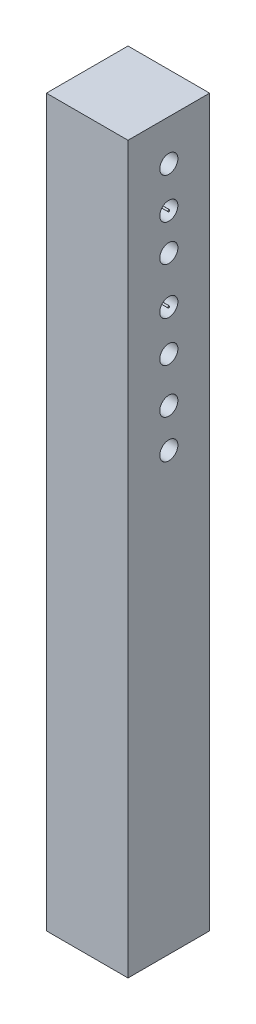
ISO-10303-21;
HEADER;
FILE_DESCRIPTION(('STEP AP214'),'2;1');
FILE_NAME('part.step','',(''),(''),'','','');
FILE_SCHEMA(('AUTOMOTIVE_DESIGN { 1 0 10303 214 1 1 1 1 }'));
ENDSEC;
DATA;
#1=APPLICATION_CONTEXT('core data for automotive mechanical design processes');
#2=APPLICATION_PROTOCOL_DEFINITION('international standard','automotive_design',2000,#1);
#3=PRODUCT_CONTEXT('',#1,'mechanical');
#4=PRODUCT('Part','Part','',(#3));
#5=PRODUCT_RELATED_PRODUCT_CATEGORY('part','',(#4));
#6=PRODUCT_DEFINITION_FORMATION('','',#4);
#7=PRODUCT_DEFINITION_CONTEXT('part definition',#1,'design');
#8=PRODUCT_DEFINITION('design','',#6,#7);
#9=PRODUCT_DEFINITION_SHAPE('','',#8);
#10=(LENGTH_UNIT() NAMED_UNIT(*) SI_UNIT(.MILLI.,.METRE.));
#11=(NAMED_UNIT(*) PLANE_ANGLE_UNIT() SI_UNIT($,.RADIAN.));
#12=(NAMED_UNIT(*) SI_UNIT($,.STERADIAN.) SOLID_ANGLE_UNIT());
#13=UNCERTAINTY_MEASURE_WITH_UNIT(LENGTH_MEASURE(1.E-05),#10,'distance_accuracy_value','');
#14=(GEOMETRIC_REPRESENTATION_CONTEXT(3) GLOBAL_UNCERTAINTY_ASSIGNED_CONTEXT((#13)) GLOBAL_UNIT_ASSIGNED_CONTEXT((#10,
#11,#12)) REPRESENTATION_CONTEXT('',''));
#15=CARTESIAN_POINT('',(0.,0.,0.));
#16=DIRECTION('',(0.,0.,1.));
#17=DIRECTION('',(1.,0.,0.));
#18=AXIS2_PLACEMENT_3D('',#15,#16,#17);
#19=CARTESIAN_POINT('',(-88.5189372888084,-800.,53.6416601542779));
#20=DIRECTION('',(-1.,0.,0.));
#21=DIRECTION('',(0.,0.,1.));
#22=AXIS2_PLACEMENT_3D('',#19,#20,#21);
#23=PLANE('',#22);
#24=CARTESIAN_POINT('',(-88.5189372888084,-44.9674941373046,8.64166015427792));
#25=DIRECTION('',(1.,0.,0.));
#26=DIRECTION('',(0.,0.,-1.));
#27=AXIS2_PLACEMENT_3D('',#24,#25,#26);
#28=CIRCLE('',#27,10.);
#29=CARTESIAN_POINT('',(-88.5189372888084,-44.9674941373046,-1.35833984572208));
#30=VERTEX_POINT('',#29);
#31=EDGE_CURVE('E51',#30,#30,#28,.T.);
#32=ORIENTED_EDGE('',*,*,#31,.T.);
#33=EDGE_LOOP('',(#32));
#34=FACE_BOUND('',#33,.T.);
#35=CARTESIAN_POINT('',(-88.5189372888084,-181.768693164414,8.64166015427792));
#36=DIRECTION('',(1.,0.,0.));
#37=DIRECTION('',(0.,0.,-1.));
#38=AXIS2_PLACEMENT_3D('',#35,#36,#37);
#39=CIRCLE('',#38,10.);
#40=CARTESIAN_POINT('',(-88.5189372888084,-181.768693164414,-1.35833984572208));
#41=VERTEX_POINT('',#40);
#42=EDGE_CURVE('E170',#41,#41,#39,.T.);
#43=ORIENTED_EDGE('',*,*,#42,.T.);
#44=EDGE_LOOP('',(#43));
#45=FACE_BOUND('',#44,.T.);
#46=CARTESIAN_POINT('',(-88.5189372888084,-89.8203462773405,8.64166015427792));
#47=DIRECTION('',(1.,0.,0.));
#48=DIRECTION('',(0.,0.,-1.));
#49=AXIS2_PLACEMENT_3D('',#46,#47,#48);
#50=CIRCLE('',#49,10.);
#51=CARTESIAN_POINT('',(-88.5189372888084,-89.8203462773405,-1.35833984572208));
#52=VERTEX_POINT('',#51);
#53=EDGE_CURVE('E150',#52,#52,#50,.T.);
#54=ORIENTED_EDGE('',*,*,#53,.T.);
#55=EDGE_LOOP('',(#54));
#56=FACE_BOUND('',#55,.T.);
#57=CARTESIAN_POINT('',(-88.5189372888084,-318.569892191523,8.64166015427792));
#58=DIRECTION('',(1.,0.,0.));
#59=DIRECTION('',(0.,0.,-1.));
#60=AXIS2_PLACEMENT_3D('',#57,#58,#59);
#61=CIRCLE('',#60,10.);
#62=CARTESIAN_POINT('',(-88.5189372888084,-318.569892191523,-1.35833984572209));
#63=VERTEX_POINT('',#62);
#64=EDGE_CURVE('E145',#63,#63,#61,.T.);
#65=ORIENTED_EDGE('',*,*,#64,.T.);
#66=EDGE_LOOP('',(#65));
#67=FACE_BOUND('',#66,.T.);
#68=CARTESIAN_POINT('',(-88.5189372888084,-275.959682658489,8.64166015427792));
#69=DIRECTION('',(1.,0.,0.));
#70=DIRECTION('',(0.,0.,-1.));
#71=AXIS2_PLACEMENT_3D('',#68,#69,#70);
#72=CIRCLE('',#71,10.);
#73=CARTESIAN_POINT('',(-88.5189372888084,-275.959682658489,-1.35833984572208));
#74=VERTEX_POINT('',#73);
#75=EDGE_CURVE('E149',#74,#74,#72,.T.);
#76=ORIENTED_EDGE('',*,*,#75,.T.);
#77=EDGE_LOOP('',(#76));
#78=FACE_BOUND('',#77,.T.);
#79=CARTESIAN_POINT('',(-88.5189372888084,-226.62154530445,8.64166015427792));
#80=DIRECTION('',(1.,0.,0.));
#81=DIRECTION('',(0.,0.,-1.));
#82=AXIS2_PLACEMENT_3D('',#79,#80,#81);
#83=CIRCLE('',#82,10.);
#84=CARTESIAN_POINT('',(-88.5189372888084,-226.62154530445,-1.35833984572208));
#85=VERTEX_POINT('',#84);
#86=EDGE_CURVE('E157',#85,#85,#83,.T.);
#87=ORIENTED_EDGE('',*,*,#86,.T.);
#88=EDGE_LOOP('',(#87));
#89=FACE_BOUND('',#88,.T.);
#90=CARTESIAN_POINT('',(-88.5189372888084,-130.187913203373,8.64166015427792));
#91=DIRECTION('',(1.,0.,0.));
#92=DIRECTION('',(0.,0.,-1.));
#93=AXIS2_PLACEMENT_3D('',#90,#91,#92);
#94=CIRCLE('',#93,10.);
#95=CARTESIAN_POINT('',(-88.5189372888084,-130.187913203373,-1.35833984572208));
#96=VERTEX_POINT('',#95);
#97=EDGE_CURVE('E138',#96,#96,#94,.T.);
#98=ORIENTED_EDGE('',*,*,#97,.T.);
#99=EDGE_LOOP('',(#98));
#100=FACE_BOUND('',#99,.T.);
#101=DIRECTION('',(0.,0.,1.));
#102=VECTOR('',#101,1.);
#103=CARTESIAN_POINT('',(-88.5189372888084,0.,53.6416601542779));
#104=LINE('',#103,#102);
#105=CARTESIAN_POINT('',(-88.5189372888084,0.,-36.3583398457221));
#106=VERTEX_POINT('',#105);
#107=CARTESIAN_POINT('',(-88.5189372888084,0.,53.6416601542779));
#108=VERTEX_POINT('',#107);
#109=EDGE_CURVE('E104',#106,#108,#104,.T.);
#110=ORIENTED_EDGE('',*,*,#109,.F.);
#111=DIRECTION('',(0.,1.,0.));
#112=VECTOR('',#111,1.);
#113=CARTESIAN_POINT('',(-88.5189372888084,-800.,-36.3583398457221));
#114=LINE('',#113,#112);
#115=CARTESIAN_POINT('',(-88.5189372888084,-800.,-36.3583398457221));
#116=VERTEX_POINT('',#115);
#117=EDGE_CURVE('E90',#116,#106,#114,.T.);
#118=ORIENTED_EDGE('',*,*,#117,.F.);
#119=DIRECTION('',(0.,0.,1.));
#120=VECTOR('',#119,1.);
#121=CARTESIAN_POINT('',(-88.5189372888084,-800.,53.6416601542779));
#122=LINE('',#121,#120);
#123=CARTESIAN_POINT('',(-88.5189372888084,-800.,53.6416601542779));
#124=VERTEX_POINT('',#123);
#125=EDGE_CURVE('E135',#116,#124,#122,.T.);
#126=ORIENTED_EDGE('',*,*,#125,.T.);
#127=DIRECTION('',(0.,1.,0.));
#128=VECTOR('',#127,1.);
#129=CARTESIAN_POINT('',(-88.5189372888084,-800.,53.6416601542779));
#130=LINE('',#129,#128);
#131=EDGE_CURVE('E105',#124,#108,#130,.T.);
#132=ORIENTED_EDGE('',*,*,#131,.T.);
#133=EDGE_LOOP('',(#110,#118,#126,#132));
#134=FACE_BOUND('',#133,.T.);
#135=ADVANCED_FACE('F48',(#34,#45,#56,#67,#78,#89,#100,#134),#23,.T.);
#136=CARTESIAN_POINT('',(-88.5189372888084,-800.,-36.3583398457221));
#137=DIRECTION('',(0.,0.,-1.));
#138=DIRECTION('',(-1.,0.,0.));
#139=AXIS2_PLACEMENT_3D('',#136,#137,#138);
#140=PLANE('',#139);
#141=DIRECTION('',(-1.,0.,0.));
#142=VECTOR('',#141,1.);
#143=CARTESIAN_POINT('',(-88.5189372888084,0.,-36.3583398457221));
#144=LINE('',#143,#142);
#145=CARTESIAN_POINT('',(1.48106271119158,0.,-36.3583398457221));
#146=VERTEX_POINT('',#145);
#147=EDGE_CURVE('E94',#146,#106,#144,.T.);
#148=ORIENTED_EDGE('',*,*,#147,.F.);
#149=DIRECTION('',(0.,1.,0.));
#150=VECTOR('',#149,1.);
#151=CARTESIAN_POINT('',(1.48106271119158,-800.,-36.3583398457221));
#152=LINE('',#151,#150);
#153=CARTESIAN_POINT('',(1.48106271119158,-800.,-36.3583398457221));
#154=VERTEX_POINT('',#153);
#155=EDGE_CURVE('E131',#154,#146,#152,.T.);
#156=ORIENTED_EDGE('',*,*,#155,.F.);
#157=DIRECTION('',(-1.,0.,0.));
#158=VECTOR('',#157,1.);
#159=CARTESIAN_POINT('',(-88.5189372888084,-800.,-36.3583398457221));
#160=LINE('',#159,#158);
#161=EDGE_CURVE('E96',#154,#116,#160,.T.);
#162=ORIENTED_EDGE('',*,*,#161,.T.);
#163=ORIENTED_EDGE('',*,*,#117,.T.);
#164=EDGE_LOOP('',(#148,#156,#162,#163));
#165=FACE_BOUND('',#164,.T.);
#166=ADVANCED_FACE('F92',(#165),#140,.T.);
#167=CARTESIAN_POINT('',(1.48106271119158,-800.,53.6416601542779));
#168=DIRECTION('',(1.,0.,0.));
#169=DIRECTION('',(0.,0.,-1.));
#170=AXIS2_PLACEMENT_3D('',#167,#168,#169);
#171=PLANE('',#170);
#172=CARTESIAN_POINT('',(1.48106271119158,-44.9674941373046,8.64166015427792));
#173=DIRECTION('',(1.,0.,0.));
#174=DIRECTION('',(0.,0.,-1.));
#175=AXIS2_PLACEMENT_3D('',#172,#173,#174);
#176=CIRCLE('',#175,10.);
#177=CARTESIAN_POINT('',(1.48106271119158,-44.9674941373046,-1.35833984572208));
#178=VERTEX_POINT('',#177);
#179=EDGE_CURVE('E12',#178,#178,#176,.T.);
#180=ORIENTED_EDGE('',*,*,#179,.F.);
#181=EDGE_LOOP('',(#180));
#182=FACE_BOUND('',#181,.T.);
#183=CARTESIAN_POINT('',(1.48106271119158,-181.768693164414,8.64166015427792));
#184=DIRECTION('',(1.,0.,0.));
#185=DIRECTION('',(0.,0.,-1.));
#186=AXIS2_PLACEMENT_3D('',#183,#184,#185);
#187=CIRCLE('',#186,10.);
#188=CARTESIAN_POINT('',(1.48106271119158,-181.768693164414,-1.35833984572208));
#189=VERTEX_POINT('',#188);
#190=EDGE_CURVE('E58',#189,#189,#187,.T.);
#191=ORIENTED_EDGE('',*,*,#190,.F.);
#192=EDGE_LOOP('',(#191));
#193=FACE_BOUND('',#192,.T.);
#194=CARTESIAN_POINT('',(1.48106271119158,-89.8203462773405,8.64166015427792));
#195=DIRECTION('',(1.,0.,0.));
#196=DIRECTION('',(0.,0.,-1.));
#197=AXIS2_PLACEMENT_3D('',#194,#195,#196);
#198=CIRCLE('',#197,10.);
#199=CARTESIAN_POINT('',(1.48106271119158,-89.8203462773405,-1.35833984572208));
#200=VERTEX_POINT('',#199);
#201=EDGE_CURVE('E143',#200,#200,#198,.T.);
#202=ORIENTED_EDGE('',*,*,#201,.F.);
#203=EDGE_LOOP('',(#202));
#204=FACE_BOUND('',#203,.T.);
#205=CARTESIAN_POINT('',(1.48106271119158,-318.569892191523,8.64166015427792));
#206=DIRECTION('',(1.,0.,0.));
#207=DIRECTION('',(0.,0.,-1.));
#208=AXIS2_PLACEMENT_3D('',#205,#206,#207);
#209=CIRCLE('',#208,10.);
#210=CARTESIAN_POINT('',(1.48106271119158,-318.569892191523,-1.35833984572209));
#211=VERTEX_POINT('',#210);
#212=EDGE_CURVE('E139',#211,#211,#209,.T.);
#213=ORIENTED_EDGE('',*,*,#212,.F.);
#214=EDGE_LOOP('',(#213));
#215=FACE_BOUND('',#214,.T.);
#216=CARTESIAN_POINT('',(1.48106271119158,-275.959682658489,8.64166015427792));
#217=DIRECTION('',(1.,0.,0.));
#218=DIRECTION('',(0.,0.,-1.));
#219=AXIS2_PLACEMENT_3D('',#216,#217,#218);
#220=CIRCLE('',#219,10.);
#221=CARTESIAN_POINT('',(1.48106271119158,-275.959682658489,-1.35833984572208));
#222=VERTEX_POINT('',#221);
#223=EDGE_CURVE('E144',#222,#222,#220,.T.);
#224=ORIENTED_EDGE('',*,*,#223,.F.);
#225=EDGE_LOOP('',(#224));
#226=FACE_BOUND('',#225,.T.);
#227=CARTESIAN_POINT('',(1.48106271119158,-226.62154530445,8.64166015427792));
#228=DIRECTION('',(1.,0.,0.));
#229=DIRECTION('',(0.,0.,-1.));
#230=AXIS2_PLACEMENT_3D('',#227,#228,#229);
#231=CIRCLE('',#230,10.);
#232=CARTESIAN_POINT('',(1.48106271119158,-226.62154530445,-1.35833984572208));
#233=VERTEX_POINT('',#232);
#234=EDGE_CURVE('E120',#233,#233,#231,.T.);
#235=ORIENTED_EDGE('',*,*,#234,.F.);
#236=EDGE_LOOP('',(#235));
#237=FACE_BOUND('',#236,.T.);
#238=CARTESIAN_POINT('',(1.48106271119158,-130.187913203373,8.64166015427792));
#239=DIRECTION('',(1.,0.,0.));
#240=DIRECTION('',(0.,0.,-1.));
#241=AXIS2_PLACEMENT_3D('',#238,#239,#240);
#242=CIRCLE('',#241,10.);
#243=CARTESIAN_POINT('',(1.48106271119158,-130.187913203373,-1.35833984572208));
#244=VERTEX_POINT('',#243);
#245=EDGE_CURVE('E115',#244,#244,#242,.T.);
#246=ORIENTED_EDGE('',*,*,#245,.F.);
#247=EDGE_LOOP('',(#246));
#248=FACE_BOUND('',#247,.T.);
#249=DIRECTION('',(0.,0.,-1.));
#250=VECTOR('',#249,1.);
#251=CARTESIAN_POINT('',(1.48106271119158,0.,53.6416601542779));
#252=LINE('',#251,#250);
#253=CARTESIAN_POINT('',(1.48106271119158,0.,53.6416601542779));
#254=VERTEX_POINT('',#253);
#255=EDGE_CURVE('E113',#254,#146,#252,.T.);
#256=ORIENTED_EDGE('',*,*,#255,.F.);
#257=DIRECTION('',(0.,1.,0.));
#258=VECTOR('',#257,1.);
#259=CARTESIAN_POINT('',(1.48106271119158,-800.,53.6416601542779));
#260=LINE('',#259,#258);
#261=CARTESIAN_POINT('',(1.48106271119158,-800.,53.6416601542779));
#262=VERTEX_POINT('',#261);
#263=EDGE_CURVE('E65',#262,#254,#260,.T.);
#264=ORIENTED_EDGE('',*,*,#263,.F.);
#265=DIRECTION('',(0.,0.,-1.));
#266=VECTOR('',#265,1.);
#267=CARTESIAN_POINT('',(1.48106271119158,-800.,53.6416601542779));
#268=LINE('',#267,#266);
#269=EDGE_CURVE('E101',#262,#154,#268,.T.);
#270=ORIENTED_EDGE('',*,*,#269,.T.);
#271=ORIENTED_EDGE('',*,*,#155,.T.);
#272=EDGE_LOOP('',(#256,#264,#270,#271));
#273=FACE_BOUND('',#272,.T.);
#274=ADVANCED_FACE('F191',(#182,#193,#204,#215,#226,#237,#248,#273),#171,.T.);
#275=CARTESIAN_POINT('',(-88.5189372888084,-800.,53.6416601542779));
#276=DIRECTION('',(0.,0.,1.));
#277=DIRECTION('',(1.,0.,0.));
#278=AXIS2_PLACEMENT_3D('',#275,#276,#277);
#279=PLANE('',#278);
#280=DIRECTION('',(1.,0.,0.));
#281=VECTOR('',#280,1.);
#282=CARTESIAN_POINT('',(-88.5189372888084,0.,53.6416601542779));
#283=LINE('',#282,#281);
#284=EDGE_CURVE('E109',#108,#254,#283,.T.);
#285=ORIENTED_EDGE('',*,*,#284,.F.);
#286=ORIENTED_EDGE('',*,*,#131,.F.);
#287=DIRECTION('',(1.,0.,0.));
#288=VECTOR('',#287,1.);
#289=CARTESIAN_POINT('',(-88.5189372888084,-800.,53.6416601542779));
#290=LINE('',#289,#288);
#291=EDGE_CURVE('E132',#124,#262,#290,.T.);
#292=ORIENTED_EDGE('',*,*,#291,.T.);
#293=ORIENTED_EDGE('',*,*,#263,.T.);
#294=EDGE_LOOP('',(#285,#286,#292,#293));
#295=FACE_BOUND('',#294,.T.);
#296=ADVANCED_FACE('F194',(#295),#279,.T.);
#297=CARTESIAN_POINT('',(0.,-800.,0.));
#298=DIRECTION('',(0.,-1.,0.));
#299=DIRECTION('',(0.,0.,-1.));
#300=AXIS2_PLACEMENT_3D('',#297,#298,#299);
#301=PLANE('',#300);
#302=ORIENTED_EDGE('',*,*,#125,.F.);
#303=ORIENTED_EDGE('',*,*,#161,.F.);
#304=ORIENTED_EDGE('',*,*,#269,.F.);
#305=ORIENTED_EDGE('',*,*,#291,.F.);
#306=EDGE_LOOP('',(#302,#303,#304,#305));
#307=FACE_BOUND('',#306,.T.);
#308=ADVANCED_FACE('F207',(#307),#301,.T.);
#309=CARTESIAN_POINT('',(0.,0.,0.));
#310=DIRECTION('',(0.,-1.,0.));
#311=DIRECTION('',(0.,0.,-1.));
#312=AXIS2_PLACEMENT_3D('',#309,#310,#311);
#313=PLANE('',#312);
#314=ORIENTED_EDGE('',*,*,#109,.T.);
#315=ORIENTED_EDGE('',*,*,#284,.T.);
#316=ORIENTED_EDGE('',*,*,#255,.T.);
#317=ORIENTED_EDGE('',*,*,#147,.T.);
#318=EDGE_LOOP('',(#314,#315,#316,#317));
#319=FACE_BOUND('',#318,.T.);
#320=ADVANCED_FACE('F112',(#319),#313,.F.);
#321=CARTESIAN_POINT('',(-88.5189372888084,-130.187913203373,8.64166015427792));
#322=DIRECTION('',(1.,0.,0.));
#323=DIRECTION('',(0.,0.,-1.));
#324=AXIS2_PLACEMENT_3D('',#321,#322,#323);
#325=CYLINDRICAL_SURFACE('',#324,10.);
#326=ORIENTED_EDGE('',*,*,#97,.F.);
#327=EDGE_LOOP('',(#326));
#328=FACE_BOUND('',#327,.T.);
#329=ORIENTED_EDGE('',*,*,#245,.T.);
#330=EDGE_LOOP('',(#329));
#331=FACE_BOUND('',#330,.T.);
#332=ADVANCED_FACE('F214',(#328,#331),#325,.F.);
#333=CARTESIAN_POINT('',(-88.5189372888084,-226.62154530445,8.64166015427792));
#334=DIRECTION('',(1.,0.,0.));
#335=DIRECTION('',(0.,0.,-1.));
#336=AXIS2_PLACEMENT_3D('',#333,#334,#335);
#337=CYLINDRICAL_SURFACE('',#336,10.);
#338=ORIENTED_EDGE('',*,*,#86,.F.);
#339=EDGE_LOOP('',(#338));
#340=FACE_BOUND('',#339,.T.);
#341=ORIENTED_EDGE('',*,*,#234,.T.);
#342=EDGE_LOOP('',(#341));
#343=FACE_BOUND('',#342,.T.);
#344=ADVANCED_FACE('F243',(#340,#343),#337,.F.);
#345=CARTESIAN_POINT('',(-88.5189372888084,-275.959682658489,8.64166015427792));
#346=DIRECTION('',(1.,0.,0.));
#347=DIRECTION('',(0.,0.,-1.));
#348=AXIS2_PLACEMENT_3D('',#345,#346,#347);
#349=CYLINDRICAL_SURFACE('',#348,10.);
#350=ORIENTED_EDGE('',*,*,#75,.F.);
#351=EDGE_LOOP('',(#350));
#352=FACE_BOUND('',#351,.T.);
#353=ORIENTED_EDGE('',*,*,#223,.T.);
#354=EDGE_LOOP('',(#353));
#355=FACE_BOUND('',#354,.T.);
#356=ADVANCED_FACE('F247',(#352,#355),#349,.F.);
#357=CARTESIAN_POINT('',(-88.5189372888084,-318.569892191523,8.64166015427792));
#358=DIRECTION('',(1.,0.,0.));
#359=DIRECTION('',(0.,0.,-1.));
#360=AXIS2_PLACEMENT_3D('',#357,#358,#359);
#361=CYLINDRICAL_SURFACE('',#360,10.);
#362=ORIENTED_EDGE('',*,*,#64,.F.);
#363=EDGE_LOOP('',(#362));
#364=FACE_BOUND('',#363,.T.);
#365=ORIENTED_EDGE('',*,*,#212,.T.);
#366=EDGE_LOOP('',(#365));
#367=FACE_BOUND('',#366,.T.);
#368=ADVANCED_FACE('F187',(#364,#367),#361,.F.);
#369=CARTESIAN_POINT('',(-88.5189372888084,-89.8203462773405,8.64166015427792));
#370=DIRECTION('',(1.,0.,0.));
#371=DIRECTION('',(0.,0.,-1.));
#372=AXIS2_PLACEMENT_3D('',#369,#370,#371);
#373=CYLINDRICAL_SURFACE('',#372,10.);
#374=ORIENTED_EDGE('',*,*,#53,.F.);
#375=EDGE_LOOP('',(#374));
#376=FACE_BOUND('',#375,.T.);
#377=ORIENTED_EDGE('',*,*,#201,.T.);
#378=EDGE_LOOP('',(#377));
#379=FACE_BOUND('',#378,.T.);
#380=ADVANCED_FACE('F183',(#376,#379),#373,.F.);
#381=CARTESIAN_POINT('',(-88.5189372888084,-181.768693164414,8.64166015427792));
#382=DIRECTION('',(1.,0.,0.));
#383=DIRECTION('',(0.,0.,-1.));
#384=AXIS2_PLACEMENT_3D('',#381,#382,#383);
#385=CYLINDRICAL_SURFACE('',#384,10.);
#386=ORIENTED_EDGE('',*,*,#42,.F.);
#387=EDGE_LOOP('',(#386));
#388=FACE_BOUND('',#387,.T.);
#389=ORIENTED_EDGE('',*,*,#190,.T.);
#390=EDGE_LOOP('',(#389));
#391=FACE_BOUND('',#390,.T.);
#392=ADVANCED_FACE('F186',(#388,#391),#385,.F.);
#393=CARTESIAN_POINT('',(-88.5189372888084,-44.9674941373046,8.64166015427792));
#394=DIRECTION('',(1.,0.,0.));
#395=DIRECTION('',(0.,0.,-1.));
#396=AXIS2_PLACEMENT_3D('',#393,#394,#395);
#397=CYLINDRICAL_SURFACE('',#396,10.);
#398=ORIENTED_EDGE('',*,*,#31,.F.);
#399=EDGE_LOOP('',(#398));
#400=FACE_BOUND('',#399,.T.);
#401=ORIENTED_EDGE('',*,*,#179,.T.);
#402=EDGE_LOOP('',(#401));
#403=FACE_BOUND('',#402,.T.);
#404=ADVANCED_FACE('F231',(#400,#403),#397,.F.);
#405=CLOSED_SHELL('',(#135,#166,#274,#296,#308,#320,#332,#344,#356,#368,#380,#392,#404));
#406=MANIFOLD_SOLID_BREP('B2',#405);
#407=CARTESIAN_POINT('',(1.48106271119158,-800.,53.6416601542779));
#408=DIRECTION('',(1.,0.,0.));
#409=DIRECTION('',(0.,0.,-1.));
#410=AXIS2_PLACEMENT_3D('',#407,#408,#409);
#411=PLANE('',#410);
#412=CARTESIAN_POINT('',(1.48106271119158,-89.8203462773405,8.64166015427792));
#413=DIRECTION('',(1.,0.,0.));
#414=DIRECTION('',(0.,0.,-1.));
#415=AXIS2_PLACEMENT_3D('',#412,#413,#414);
#416=CIRCLE('',#415,1.);
#417=CARTESIAN_POINT('',(1.48106271119158,-89.8203462773405,7.64166015427792));
#418=VERTEX_POINT('',#417);
#419=EDGE_CURVE('E359',#418,#418,#416,.T.);
#420=ORIENTED_EDGE('',*,*,#419,.T.);
#421=EDGE_LOOP('',(#420));
#422=FACE_BOUND('',#421,.T.);
#423=ADVANCED_FACE('F352',(#422),#411,.T.);
#424=CARTESIAN_POINT('',(-88.5189372888084,-89.8203462773405,8.64166015427792));
#425=DIRECTION('',(1.,0.,0.));
#426=DIRECTION('',(0.,0.,-1.));
#427=AXIS2_PLACEMENT_3D('',#424,#425,#426);
#428=CYLINDRICAL_SURFACE('',#427,1.);
#429=CARTESIAN_POINT('',(-88.5189372888084,-89.8203462773405,8.64166015427792));
#430=DIRECTION('',(1.,0.,0.));
#431=DIRECTION('',(0.,0.,-1.));
#432=AXIS2_PLACEMENT_3D('',#429,#430,#431);
#433=CIRCLE('',#432,1.);
#434=CARTESIAN_POINT('',(-88.5189372888084,-89.8203462773405,7.64166015427792));
#435=VERTEX_POINT('',#434);
#436=EDGE_CURVE('E47',#435,#435,#433,.T.);
#437=ORIENTED_EDGE('',*,*,#436,.T.);
#438=EDGE_LOOP('',(#437));
#439=FACE_BOUND('',#438,.T.);
#440=ORIENTED_EDGE('',*,*,#419,.F.);
#441=EDGE_LOOP('',(#440));
#442=FACE_BOUND('',#441,.T.);
#443=ADVANCED_FACE('F366',(#439,#442),#428,.T.);
#444=CARTESIAN_POINT('',(-88.5189372888084,-800.,53.6416601542779));
#445=DIRECTION('',(-1.,0.,0.));
#446=DIRECTION('',(0.,0.,1.));
#447=AXIS2_PLACEMENT_3D('',#444,#445,#446);
#448=PLANE('',#447);
#449=ORIENTED_EDGE('',*,*,#436,.F.);
#450=EDGE_LOOP('',(#449));
#451=FACE_BOUND('',#450,.T.);
#452=ADVANCED_FACE('F354',(#451),#448,.T.);
#453=CLOSED_SHELL('',(#423,#443,#452));
#454=MANIFOLD_SOLID_BREP('B6',#453);
#455=CARTESIAN_POINT('',(1.48106271119158,-800.,53.6416601542779));
#456=DIRECTION('',(1.,0.,0.));
#457=DIRECTION('',(0.,0.,-1.));
#458=AXIS2_PLACEMENT_3D('',#455,#456,#457);
#459=PLANE('',#458);
#460=CARTESIAN_POINT('',(1.48106271119158,-181.768693164414,8.64166015427792));
#461=DIRECTION('',(1.,0.,0.));
#462=DIRECTION('',(0.,0.,-1.));
#463=AXIS2_PLACEMENT_3D('',#460,#461,#462);
#464=CIRCLE('',#463,1.);
#465=CARTESIAN_POINT('',(1.48106271119158,-181.768693164414,7.64166015427792));
#466=VERTEX_POINT('',#465);
#467=EDGE_CURVE('E397',#466,#466,#464,.T.);
#468=ORIENTED_EDGE('',*,*,#467,.T.);
#469=EDGE_LOOP('',(#468));
#470=FACE_BOUND('',#469,.T.);
#471=ADVANCED_FACE('F393',(#470),#459,.T.);
#472=CARTESIAN_POINT('',(-88.5189372888084,-181.768693164414,8.64166015427792));
#473=DIRECTION('',(1.,0.,0.));
#474=DIRECTION('',(0.,0.,-1.));
#475=AXIS2_PLACEMENT_3D('',#472,#473,#474);
#476=CYLINDRICAL_SURFACE('',#475,1.);
#477=CARTESIAN_POINT('',(-88.5189372888084,-181.768693164414,8.64166015427792));
#478=DIRECTION('',(1.,0.,0.));
#479=DIRECTION('',(0.,0.,-1.));
#480=AXIS2_PLACEMENT_3D('',#477,#478,#479);
#481=CIRCLE('',#480,1.);
#482=CARTESIAN_POINT('',(-88.5189372888084,-181.768693164414,7.64166015427792));
#483=VERTEX_POINT('',#482);
#484=EDGE_CURVE('E351',#483,#483,#481,.T.);
#485=ORIENTED_EDGE('',*,*,#484,.T.);
#486=EDGE_LOOP('',(#485));
#487=FACE_BOUND('',#486,.T.);
#488=ORIENTED_EDGE('',*,*,#467,.F.);
#489=EDGE_LOOP('',(#488));
#490=FACE_BOUND('',#489,.T.);
#491=ADVANCED_FACE('F407',(#487,#490),#476,.T.);
#492=CARTESIAN_POINT('',(-88.5189372888084,-800.,53.6416601542779));
#493=DIRECTION('',(-1.,0.,0.));
#494=DIRECTION('',(0.,0.,1.));
#495=AXIS2_PLACEMENT_3D('',#492,#493,#494);
#496=PLANE('',#495);
#497=ORIENTED_EDGE('',*,*,#484,.F.);
#498=EDGE_LOOP('',(#497));
#499=FACE_BOUND('',#498,.T.);
#500=ADVANCED_FACE('F395',(#499),#496,.T.);
#501=CLOSED_SHELL('',(#471,#491,#500));
#502=MANIFOLD_SOLID_BREP('B42',#501);
#503=ADVANCED_BREP_SHAPE_REPRESENTATION('',(#18,#406,#454,#502),#14);
#504=SHAPE_DEFINITION_REPRESENTATION(#9,#503);
ENDSEC;
END-ISO-10303-21;
